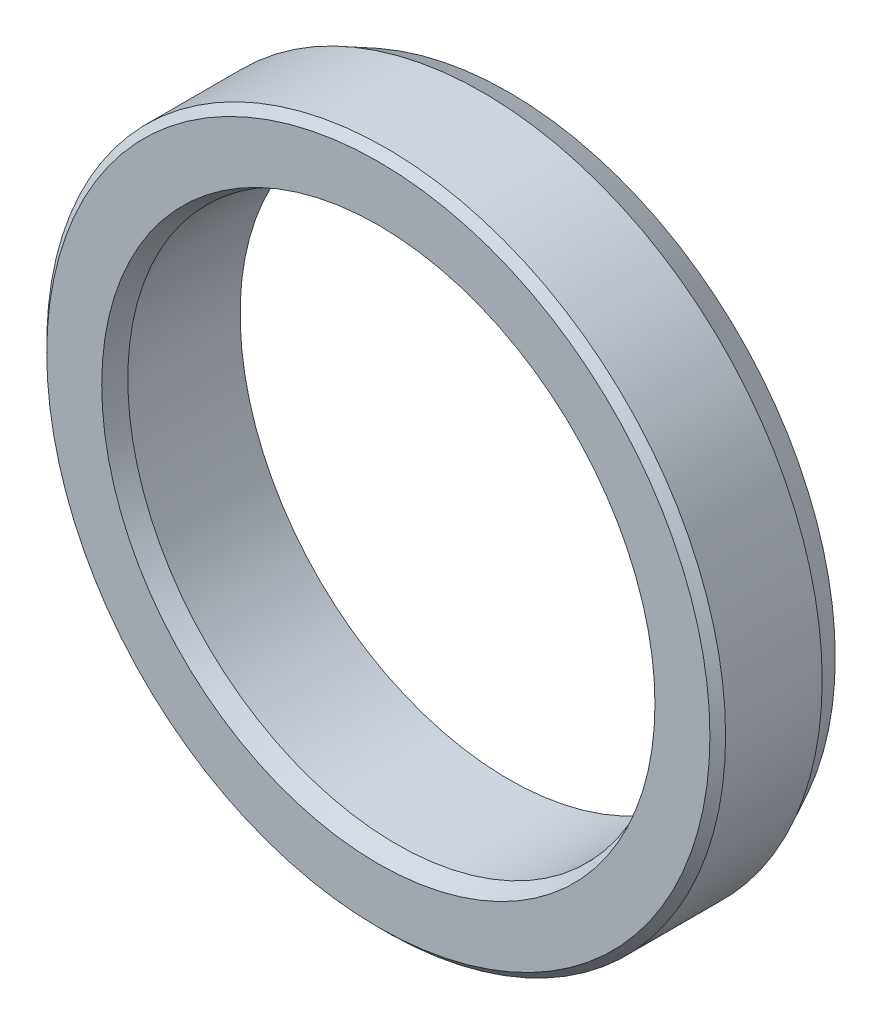
ISO-10303-21;
HEADER;
FILE_DESCRIPTION(('STEP AP214'),'2;1');
FILE_NAME('part.step','',(''),(''),'','','');
FILE_SCHEMA(('AUTOMOTIVE_DESIGN { 1 0 10303 214 1 1 1 1 }'));
ENDSEC;
DATA;
#1=APPLICATION_CONTEXT('core data for automotive mechanical design processes');
#2=APPLICATION_PROTOCOL_DEFINITION('international standard','automotive_design',2000,#1);
#3=PRODUCT_CONTEXT('',#1,'mechanical');
#4=PRODUCT('Part','Part','',(#3));
#5=PRODUCT_RELATED_PRODUCT_CATEGORY('part','',(#4));
#6=PRODUCT_DEFINITION_FORMATION('','',#4);
#7=PRODUCT_DEFINITION_CONTEXT('part definition',#1,'design');
#8=PRODUCT_DEFINITION('design','',#6,#7);
#9=PRODUCT_DEFINITION_SHAPE('','',#8);
#10=(LENGTH_UNIT() NAMED_UNIT(*) SI_UNIT(.MILLI.,.METRE.));
#11=(NAMED_UNIT(*) PLANE_ANGLE_UNIT() SI_UNIT($,.RADIAN.));
#12=(NAMED_UNIT(*) SI_UNIT($,.STERADIAN.) SOLID_ANGLE_UNIT());
#13=UNCERTAINTY_MEASURE_WITH_UNIT(LENGTH_MEASURE(1.E-05),#10,'distance_accuracy_value','');
#14=(GEOMETRIC_REPRESENTATION_CONTEXT(3) GLOBAL_UNCERTAINTY_ASSIGNED_CONTEXT((#13)) GLOBAL_UNIT_ASSIGNED_CONTEXT((#10,
#11,#12)) REPRESENTATION_CONTEXT('',''));
#15=CARTESIAN_POINT('',(0.,0.,0.));
#16=DIRECTION('',(0.,0.,1.));
#17=DIRECTION('',(1.,0.,0.));
#18=AXIS2_PLACEMENT_3D('',#15,#16,#17);
#19=CARTESIAN_POINT('',(0.,0.,2.));
#20=DIRECTION('',(0.,0.,1.));
#21=DIRECTION('',(-1.,0.,0.));
#22=AXIS2_PLACEMENT_3D('',#19,#20,#21);
#23=CYLINDRICAL_SURFACE('',#22,13.);
#24=CARTESIAN_POINT('',(0.,0.,6.7));
#25=DIRECTION('',(0.,0.,-1.));
#26=DIRECTION('',(1.,0.,0.));
#27=AXIS2_PLACEMENT_3D('',#24,#25,#26);
#28=CIRCLE('',#27,13.);
#29=CARTESIAN_POINT('',(13.,0.,6.7));
#30=VERTEX_POINT('',#29);
#31=EDGE_CURVE('E11',#30,#30,#28,.T.);
#32=ORIENTED_EDGE('',*,*,#31,.T.);
#33=EDGE_LOOP('',(#32));
#34=FACE_BOUND('',#33,.T.);
#35=CARTESIAN_POINT('',(0.,0.,3.));
#36=DIRECTION('',(0.,0.,1.));
#37=DIRECTION('',(1.,0.,0.));
#38=AXIS2_PLACEMENT_3D('',#35,#36,#37);
#39=CIRCLE('',#38,13.);
#40=CARTESIAN_POINT('',(13.,0.,3.));
#41=VERTEX_POINT('',#40);
#42=EDGE_CURVE('E28',#41,#41,#39,.T.);
#43=ORIENTED_EDGE('',*,*,#42,.T.);
#44=EDGE_LOOP('',(#43));
#45=FACE_BOUND('',#44,.T.);
#46=ADVANCED_FACE('F17',(#34,#45),#23,.T.);
#47=CARTESIAN_POINT('',(0.,0.,2.));
#48=DIRECTION('',(0.,0.,1.));
#49=DIRECTION('',(-1.,0.,0.));
#50=AXIS2_PLACEMENT_3D('',#47,#48,#49);
#51=CYLINDRICAL_SURFACE('',#50,10.295);
#52=CARTESIAN_POINT('',(0.,0.,6.3));
#53=DIRECTION('',(0.,0.,1.));
#54=DIRECTION('',(1.,0.,0.));
#55=AXIS2_PLACEMENT_3D('',#52,#53,#54);
#56=CIRCLE('',#55,10.295);
#57=CARTESIAN_POINT('',(10.295,0.,6.3));
#58=VERTEX_POINT('',#57);
#59=EDGE_CURVE('E70',#58,#58,#56,.T.);
#60=ORIENTED_EDGE('',*,*,#59,.T.);
#61=EDGE_LOOP('',(#60));
#62=FACE_BOUND('',#61,.T.);
#63=CARTESIAN_POINT('',(0.,0.,2.));
#64=DIRECTION('',(0.,0.,-1.));
#65=DIRECTION('',(1.,0.,0.));
#66=AXIS2_PLACEMENT_3D('',#63,#64,#65);
#67=CIRCLE('',#66,10.295);
#68=CARTESIAN_POINT('',(10.295,0.,2.));
#69=VERTEX_POINT('',#68);
#70=EDGE_CURVE('E64',#69,#69,#67,.T.);
#71=ORIENTED_EDGE('',*,*,#70,.T.);
#72=EDGE_LOOP('',(#71));
#73=FACE_BOUND('',#72,.T.);
#74=ADVANCED_FACE('F91',(#62,#73),#51,.F.);
#75=CARTESIAN_POINT('',(0.,0.,2.));
#76=DIRECTION('',(0.,0.,1.));
#77=DIRECTION('',(-1.,0.,0.));
#78=AXIS2_PLACEMENT_3D('',#75,#76,#77);
#79=PLANE('',#78);
#80=CARTESIAN_POINT('',(0.,0.,2.));
#81=DIRECTION('',(0.,0.,-1.));
#82=DIRECTION('',(1.,0.,0.));
#83=AXIS2_PLACEMENT_3D('',#80,#81,#82);
#84=CIRCLE('',#83,12.5);
#85=CARTESIAN_POINT('',(12.5,0.,2.));
#86=VERTEX_POINT('',#85);
#87=EDGE_CURVE('E59',#86,#86,#84,.T.);
#88=ORIENTED_EDGE('',*,*,#87,.T.);
#89=EDGE_LOOP('',(#88));
#90=FACE_BOUND('',#89,.T.);
#91=ORIENTED_EDGE('',*,*,#70,.F.);
#92=EDGE_LOOP('',(#91));
#93=FACE_BOUND('',#92,.T.);
#94=ADVANCED_FACE('F88',(#90,#93),#79,.F.);
#95=CARTESIAN_POINT('',(0.,0.,7.));
#96=DIRECTION('',(0.,0.,1.));
#97=DIRECTION('',(-1.,0.,0.));
#98=AXIS2_PLACEMENT_3D('',#95,#96,#97);
#99=PLANE('',#98);
#100=CARTESIAN_POINT('',(0.,0.,7.));
#101=DIRECTION('',(0.,0.,-1.));
#102=DIRECTION('',(1.,0.,0.));
#103=AXIS2_PLACEMENT_3D('',#100,#101,#102);
#104=CIRCLE('',#103,10.595);
#105=CARTESIAN_POINT('',(10.595,0.,7.));
#106=VERTEX_POINT('',#105);
#107=EDGE_CURVE('E49',#106,#106,#104,.T.);
#108=ORIENTED_EDGE('',*,*,#107,.T.);
#109=EDGE_LOOP('',(#108));
#110=FACE_BOUND('',#109,.T.);
#111=CARTESIAN_POINT('',(0.,0.,7.));
#112=DIRECTION('',(0.,0.,1.));
#113=DIRECTION('',(1.,0.,0.));
#114=AXIS2_PLACEMENT_3D('',#111,#112,#113);
#115=CIRCLE('',#114,12.7);
#116=CARTESIAN_POINT('',(12.7,0.,7.));
#117=VERTEX_POINT('',#116);
#118=EDGE_CURVE('E21',#117,#117,#115,.T.);
#119=ORIENTED_EDGE('',*,*,#118,.T.);
#120=EDGE_LOOP('',(#119));
#121=FACE_BOUND('',#120,.T.);
#122=ADVANCED_FACE('F81',(#110,#121),#99,.T.);
#123=CARTESIAN_POINT('',(0.,0.,2.));
#124=DIRECTION('',(0.,0.,1.));
#125=DIRECTION('',(-1.,0.,0.));
#126=AXIS2_PLACEMENT_3D('',#123,#124,#125);
#127=CONICAL_SURFACE('',#126,12.5,0.463647609000806);
#128=ORIENTED_EDGE('',*,*,#87,.F.);
#129=EDGE_LOOP('',(#128));
#130=FACE_BOUND('',#129,.T.);
#131=ORIENTED_EDGE('',*,*,#42,.F.);
#132=EDGE_LOOP('',(#131));
#133=FACE_BOUND('',#132,.T.);
#134=ADVANCED_FACE('F79',(#130,#133),#127,.T.);
#135=CARTESIAN_POINT('',(0.,0.,7.));
#136=DIRECTION('',(0.,0.,-1.));
#137=DIRECTION('',(1.,0.,0.));
#138=AXIS2_PLACEMENT_3D('',#135,#136,#137);
#139=CONICAL_SURFACE('',#138,12.7,0.785398163397448);
#140=ORIENTED_EDGE('',*,*,#31,.F.);
#141=EDGE_LOOP('',(#140));
#142=FACE_BOUND('',#141,.T.);
#143=ORIENTED_EDGE('',*,*,#118,.F.);
#144=EDGE_LOOP('',(#143));
#145=FACE_BOUND('',#144,.T.);
#146=ADVANCED_FACE('F53',(#142,#145),#139,.T.);
#147=CARTESIAN_POINT('',(0.,0.,7.));
#148=DIRECTION('',(0.,0.,1.));
#149=DIRECTION('',(-1.,0.,0.));
#150=AXIS2_PLACEMENT_3D('',#147,#148,#149);
#151=CONICAL_SURFACE('',#150,10.595,0.404891786285084);
#152=ORIENTED_EDGE('',*,*,#59,.F.);
#153=EDGE_LOOP('',(#152));
#154=FACE_BOUND('',#153,.T.);
#155=ORIENTED_EDGE('',*,*,#107,.F.);
#156=EDGE_LOOP('',(#155));
#157=FACE_BOUND('',#156,.T.);
#158=ADVANCED_FACE('F19',(#154,#157),#151,.F.);
#159=CLOSED_SHELL('',(#46,#74,#94,#122,#134,#146,#158));
#160=MANIFOLD_SOLID_BREP('B1',#159);
#161=ADVANCED_BREP_SHAPE_REPRESENTATION('',(#18,#160),#14);
#162=SHAPE_DEFINITION_REPRESENTATION(#9,#161);
ENDSEC;
END-ISO-10303-21;
